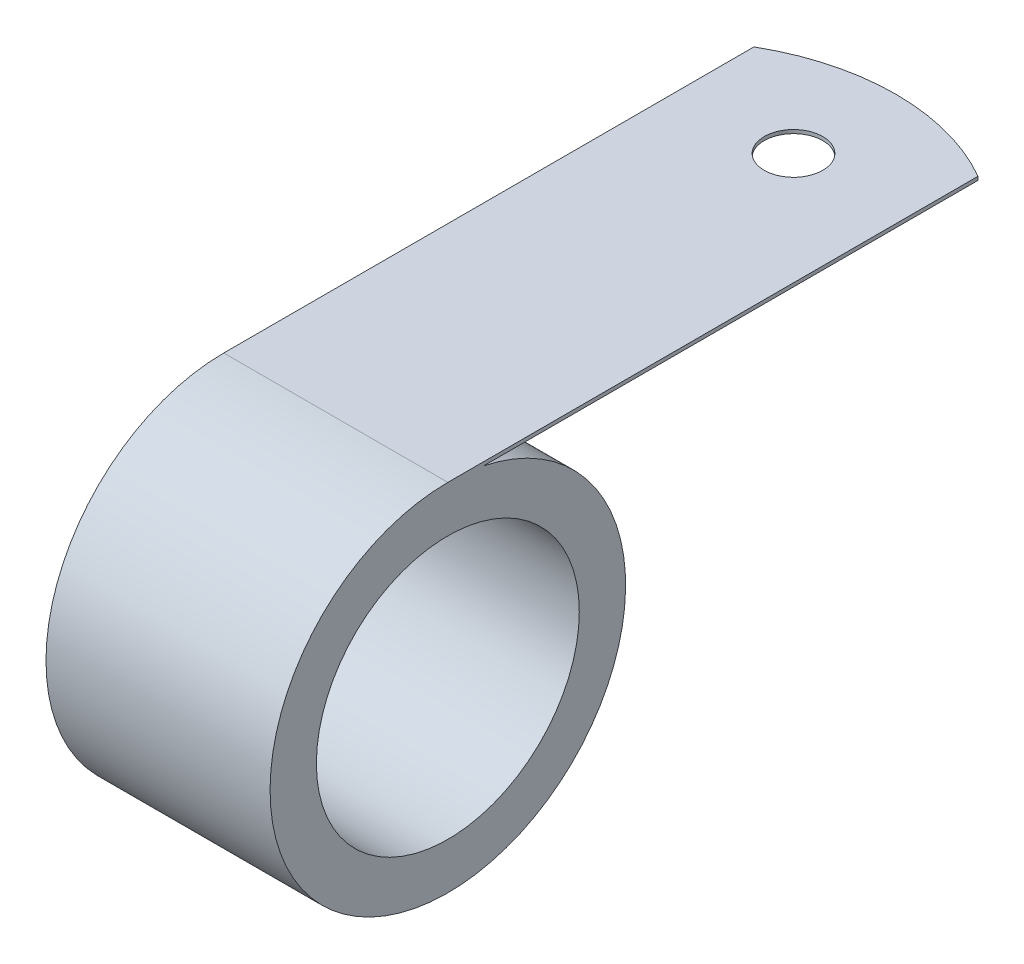
ISO-10303-21;
HEADER;
FILE_DESCRIPTION(('STEP AP214'),'2;1');
FILE_NAME('part.step','',(''),(''),'','','');
FILE_SCHEMA(('AUTOMOTIVE_DESIGN { 1 0 10303 214 1 1 1 1 }'));
ENDSEC;
DATA;
#1=APPLICATION_CONTEXT('core data for automotive mechanical design processes');
#2=APPLICATION_PROTOCOL_DEFINITION('international standard','automotive_design',2000,#1);
#3=PRODUCT_CONTEXT('',#1,'mechanical');
#4=PRODUCT('Part','Part','',(#3));
#5=PRODUCT_RELATED_PRODUCT_CATEGORY('part','',(#4));
#6=PRODUCT_DEFINITION_FORMATION('','',#4);
#7=PRODUCT_DEFINITION_CONTEXT('part definition',#1,'design');
#8=PRODUCT_DEFINITION('design','',#6,#7);
#9=PRODUCT_DEFINITION_SHAPE('','',#8);
#10=(LENGTH_UNIT() NAMED_UNIT(*) SI_UNIT(.MILLI.,.METRE.));
#11=(NAMED_UNIT(*) PLANE_ANGLE_UNIT() SI_UNIT($,.RADIAN.));
#12=(NAMED_UNIT(*) SI_UNIT($,.STERADIAN.) SOLID_ANGLE_UNIT());
#13=UNCERTAINTY_MEASURE_WITH_UNIT(LENGTH_MEASURE(1.E-05),#10,'distance_accuracy_value','');
#14=(GEOMETRIC_REPRESENTATION_CONTEXT(3) GLOBAL_UNCERTAINTY_ASSIGNED_CONTEXT((#13)) GLOBAL_UNIT_ASSIGNED_CONTEXT((#10,
#11,#12)) REPRESENTATION_CONTEXT('',''));
#15=CARTESIAN_POINT('',(0.,0.,0.));
#16=DIRECTION('',(0.,0.,1.));
#17=DIRECTION('',(1.,0.,0.));
#18=AXIS2_PLACEMENT_3D('',#15,#16,#17);
#19=CARTESIAN_POINT('',(9.525,0.,0.));
#20=DIRECTION('',(1.,0.,0.));
#21=DIRECTION('',(0.,0.,-1.));
#22=AXIS2_PLACEMENT_3D('',#19,#20,#21);
#23=PLANE('',#22);
#24=DIRECTION('',(0.,1.,0.));
#25=VECTOR('',#24,1.);
#26=CARTESIAN_POINT('',(9.525,-15.114,-45.0727839420936));
#27=LINE('',#26,#25);
#28=CARTESIAN_POINT('',(9.525,14.8082,-45.0727839420936));
#29=VERTEX_POINT('',#28);
#30=CARTESIAN_POINT('',(9.525,15.113,-45.0727839420936));
#31=VERTEX_POINT('',#30);
#32=EDGE_CURVE('E69',#29,#31,#27,.T.);
#33=ORIENTED_EDGE('',*,*,#32,.T.);
#34=DIRECTION('',(0.,0.,1.));
#35=VECTOR('',#34,1.);
#36=CARTESIAN_POINT('',(9.525,15.113,0.));
#37=LINE('',#36,#35);
#38=CARTESIAN_POINT('',(9.525,15.113,0.));
#39=VERTEX_POINT('',#38);
#40=EDGE_CURVE('E50',#31,#39,#37,.T.);
#41=ORIENTED_EDGE('',*,*,#40,.T.);
#42=CARTESIAN_POINT('',(9.525,0.,0.));
#43=DIRECTION('',(1.,0.,0.));
#44=DIRECTION('',(0.,0.,-1.));
#45=AXIS2_PLACEMENT_3D('',#42,#43,#44);
#46=CIRCLE('',#45,15.113);
#47=CARTESIAN_POINT('',(9.525,14.8082,-3.01993075417301));
#48=VERTEX_POINT('',#47);
#49=EDGE_CURVE('E94',#39,#48,#46,.T.);
#50=ORIENTED_EDGE('',*,*,#49,.T.);
#51=DIRECTION('',(0.,0.,-1.));
#52=VECTOR('',#51,1.);
#53=CARTESIAN_POINT('',(9.525,14.8082,-3.01993075417301));
#54=LINE('',#53,#52);
#55=EDGE_CURVE('E96',#48,#29,#54,.T.);
#56=ORIENTED_EDGE('',*,*,#55,.T.);
#57=EDGE_LOOP('',(#33,#41,#50,#56));
#58=FACE_BOUND('',#57,.T.);
#59=CARTESIAN_POINT('',(9.525,0.,0.));
#60=DIRECTION('',(1.,0.,0.));
#61=DIRECTION('',(0.,0.,-1.));
#62=AXIS2_PLACEMENT_3D('',#59,#60,#61);
#63=CIRCLE('',#62,11.176);
#64=CARTESIAN_POINT('',(9.525,0.,11.176));
#65=VERTEX_POINT('',#64);
#66=EDGE_CURVE('E105',#65,#65,#63,.T.);
#67=ORIENTED_EDGE('',*,*,#66,.F.);
#68=EDGE_LOOP('',(#67));
#69=FACE_BOUND('',#68,.T.);
#70=ADVANCED_FACE('F33',(#58,#69),#23,.T.);
#71=CARTESIAN_POINT('',(-9.525,0.,0.));
#72=DIRECTION('',(1.,0.,0.));
#73=DIRECTION('',(0.,0.,-1.));
#74=AXIS2_PLACEMENT_3D('',#71,#72,#73);
#75=PLANE('',#74);
#76=DIRECTION('',(0.,0.,1.));
#77=VECTOR('',#76,1.);
#78=CARTESIAN_POINT('',(-9.525,15.113,0.));
#79=LINE('',#78,#77);
#80=CARTESIAN_POINT('',(-9.525,15.113,-45.0727839420936));
#81=VERTEX_POINT('',#80);
#82=CARTESIAN_POINT('',(-9.525,15.113,0.));
#83=VERTEX_POINT('',#82);
#84=EDGE_CURVE('E82',#81,#83,#79,.T.);
#85=ORIENTED_EDGE('',*,*,#84,.F.);
#86=DIRECTION('',(0.,1.,0.));
#87=VECTOR('',#86,1.);
#88=CARTESIAN_POINT('',(-9.525,-15.114,-45.0727839420936));
#89=LINE('',#88,#87);
#90=CARTESIAN_POINT('',(-9.525,14.8082,-45.0727839420936));
#91=VERTEX_POINT('',#90);
#92=EDGE_CURVE('E86',#91,#81,#89,.T.);
#93=ORIENTED_EDGE('',*,*,#92,.F.);
#94=DIRECTION('',(0.,0.,-1.));
#95=VECTOR('',#94,1.);
#96=CARTESIAN_POINT('',(-9.525,14.8082,-3.01993075417301));
#97=LINE('',#96,#95);
#98=CARTESIAN_POINT('',(-9.525,14.8082,-3.01993075417301));
#99=VERTEX_POINT('',#98);
#100=EDGE_CURVE('E62',#99,#91,#97,.T.);
#101=ORIENTED_EDGE('',*,*,#100,.F.);
#102=CARTESIAN_POINT('',(-9.525,0.,0.));
#103=DIRECTION('',(1.,0.,0.));
#104=DIRECTION('',(0.,0.,-1.));
#105=AXIS2_PLACEMENT_3D('',#102,#103,#104);
#106=CIRCLE('',#105,15.113);
#107=EDGE_CURVE('E93',#83,#99,#106,.T.);
#108=ORIENTED_EDGE('',*,*,#107,.F.);
#109=EDGE_LOOP('',(#85,#93,#101,#108));
#110=FACE_BOUND('',#109,.T.);
#111=CARTESIAN_POINT('',(-9.525,0.,0.));
#112=DIRECTION('',(1.,0.,0.));
#113=DIRECTION('',(0.,0.,-1.));
#114=AXIS2_PLACEMENT_3D('',#111,#112,#113);
#115=CIRCLE('',#114,11.176);
#116=CARTESIAN_POINT('',(-9.525,0.,11.176));
#117=VERTEX_POINT('',#116);
#118=EDGE_CURVE('E108',#117,#117,#115,.T.);
#119=ORIENTED_EDGE('',*,*,#118,.T.);
#120=EDGE_LOOP('',(#119));
#121=FACE_BOUND('',#120,.T.);
#122=ADVANCED_FACE('F90',(#110,#121),#75,.F.);
#123=CARTESIAN_POINT('',(9.525,0.,0.));
#124=DIRECTION('',(-1.,0.,0.));
#125=DIRECTION('',(0.,0.,1.));
#126=AXIS2_PLACEMENT_3D('',#123,#124,#125);
#127=CYLINDRICAL_SURFACE('',#126,15.113);
#128=ORIENTED_EDGE('',*,*,#107,.T.);
#129=DIRECTION('',(-1.,0.,0.));
#130=VECTOR('',#129,1.);
#131=CARTESIAN_POINT('',(9.525,14.8082,-3.01993075417301));
#132=LINE('',#131,#130);
#133=EDGE_CURVE('E11',#48,#99,#132,.T.);
#134=ORIENTED_EDGE('',*,*,#133,.F.);
#135=ORIENTED_EDGE('',*,*,#49,.F.);
#136=DIRECTION('',(-1.,0.,0.));
#137=VECTOR('',#136,1.);
#138=CARTESIAN_POINT('',(9.525,15.113,0.));
#139=LINE('',#138,#137);
#140=EDGE_CURVE('E42',#39,#83,#139,.T.);
#141=ORIENTED_EDGE('',*,*,#140,.T.);
#142=EDGE_LOOP('',(#128,#134,#135,#141));
#143=FACE_BOUND('',#142,.T.);
#144=ADVANCED_FACE('F35',(#143),#127,.T.);
#145=CARTESIAN_POINT('',(9.525,14.8082,-3.01993075417301));
#146=DIRECTION('',(0.,1.,0.));
#147=DIRECTION('',(0.,0.,1.));
#148=AXIS2_PLACEMENT_3D('',#145,#146,#147);
#149=PLANE('',#148);
#150=CARTESIAN_POINT('',(0.,14.8082,-38.9128));
#151=DIRECTION('',(0.,1.,0.));
#152=DIRECTION('',(0.,0.,1.));
#153=AXIS2_PLACEMENT_3D('',#150,#151,#152);
#154=CIRCLE('',#153,2.4892);
#155=CARTESIAN_POINT('',(0.,14.8082,-36.4236));
#156=VERTEX_POINT('',#155);
#157=EDGE_CURVE('E117',#156,#156,#154,.F.);
#158=ORIENTED_EDGE('',*,*,#157,.F.);
#159=EDGE_LOOP('',(#158));
#160=FACE_BOUND('',#159,.T.);
#161=ORIENTED_EDGE('',*,*,#100,.T.);
#162=CARTESIAN_POINT('',(0.,14.8082,-28.575));
#163=DIRECTION('',(0.,1.,0.));
#164=DIRECTION('',(0.,0.,1.));
#165=AXIS2_PLACEMENT_3D('',#162,#163,#164);
#166=CIRCLE('',#165,19.05);
#167=EDGE_CURVE('E84',#29,#91,#166,.T.);
#168=ORIENTED_EDGE('',*,*,#167,.F.);
#169=ORIENTED_EDGE('',*,*,#55,.F.);
#170=ORIENTED_EDGE('',*,*,#133,.T.);
#171=EDGE_LOOP('',(#161,#168,#169,#170));
#172=FACE_BOUND('',#171,.T.);
#173=ADVANCED_FACE('F128',(#160,#172),#149,.F.);
#174=CARTESIAN_POINT('',(9.525,15.113,0.));
#175=DIRECTION('',(0.,-1.,0.));
#176=DIRECTION('',(0.,0.,-1.));
#177=AXIS2_PLACEMENT_3D('',#174,#175,#176);
#178=PLANE('',#177);
#179=CARTESIAN_POINT('',(0.,15.113,-38.9128));
#180=DIRECTION('',(0.,1.,0.));
#181=DIRECTION('',(0.,0.,1.));
#182=AXIS2_PLACEMENT_3D('',#179,#180,#181);
#183=CIRCLE('',#182,2.4892);
#184=CARTESIAN_POINT('',(0.,15.113,-36.4236));
#185=VERTEX_POINT('',#184);
#186=EDGE_CURVE('E88',#185,#185,#183,.T.);
#187=ORIENTED_EDGE('',*,*,#186,.F.);
#188=EDGE_LOOP('',(#187));
#189=FACE_BOUND('',#188,.T.);
#190=CARTESIAN_POINT('',(0.,15.113,-28.575));
#191=DIRECTION('',(0.,-1.,0.));
#192=DIRECTION('',(0.,0.,1.));
#193=AXIS2_PLACEMENT_3D('',#190,#191,#192);
#194=CIRCLE('',#193,19.05);
#195=EDGE_CURVE('E78',#81,#31,#194,.T.);
#196=ORIENTED_EDGE('',*,*,#195,.F.);
#197=ORIENTED_EDGE('',*,*,#84,.T.);
#198=ORIENTED_EDGE('',*,*,#140,.F.);
#199=ORIENTED_EDGE('',*,*,#40,.F.);
#200=EDGE_LOOP('',(#196,#197,#198,#199));
#201=FACE_BOUND('',#200,.T.);
#202=ADVANCED_FACE('F80',(#189,#201),#178,.F.);
#203=CARTESIAN_POINT('',(9.525,0.,0.));
#204=DIRECTION('',(-1.,0.,0.));
#205=DIRECTION('',(0.,0.,1.));
#206=AXIS2_PLACEMENT_3D('',#203,#204,#205);
#207=CYLINDRICAL_SURFACE('',#206,11.176);
#208=CARTESIAN_POINT('',(9.525,0.,11.176));
#209=CARTESIAN_POINT('',(9.3265625,0.,11.176));
#210=CARTESIAN_POINT('',(9.128125,0.,11.176));
#211=CARTESIAN_POINT('',(8.73125,0.,11.176));
#212=CARTESIAN_POINT('',(8.5328125,0.,11.176));
#213=CARTESIAN_POINT('',(8.1359375,0.,11.176));
#214=CARTESIAN_POINT('',(7.9375,0.,11.176));
#215=CARTESIAN_POINT('',(7.540625,0.,11.176));
#216=CARTESIAN_POINT('',(7.3421875,0.,11.176));
#217=CARTESIAN_POINT('',(6.9453125,0.,11.176));
#218=CARTESIAN_POINT('',(6.746875,0.,11.176));
#219=CARTESIAN_POINT('',(6.35,0.,11.176));
#220=CARTESIAN_POINT('',(6.1515625,0.,11.176));
#221=CARTESIAN_POINT('',(5.7546875,0.,11.176));
#222=CARTESIAN_POINT('',(5.55625,0.,11.176));
#223=CARTESIAN_POINT('',(5.159375,0.,11.176));
#224=CARTESIAN_POINT('',(4.9609375,0.,11.176));
#225=CARTESIAN_POINT('',(4.5640625,0.,11.176));
#226=CARTESIAN_POINT('',(4.365625,0.,11.176));
#227=CARTESIAN_POINT('',(3.96875,0.,11.176));
#228=CARTESIAN_POINT('',(3.7703125,0.,11.176));
#229=CARTESIAN_POINT('',(3.3734375,0.,11.176));
#230=CARTESIAN_POINT('',(3.175,0.,11.176));
#231=CARTESIAN_POINT('',(2.778125,0.,11.176));
#232=CARTESIAN_POINT('',(2.5796875,0.,11.176));
#233=CARTESIAN_POINT('',(2.1828125,0.,11.176));
#234=CARTESIAN_POINT('',(1.984375,0.,11.176));
#235=CARTESIAN_POINT('',(1.5875,0.,11.176));
#236=CARTESIAN_POINT('',(1.3890625,0.,11.176));
#237=CARTESIAN_POINT('',(0.992187499999999,0.,11.176));
#238=CARTESIAN_POINT('',(0.793749999999999,0.,11.176));
#239=CARTESIAN_POINT('',(0.396874999999998,0.,11.176));
#240=CARTESIAN_POINT('',(0.198437499999998,0.,11.176));
#241=CARTESIAN_POINT('',(-0.198437500000002,0.,11.176));
#242=CARTESIAN_POINT('',(-0.396875000000002,0.,11.176));
#243=CARTESIAN_POINT('',(-0.793750000000002,0.,11.176));
#244=CARTESIAN_POINT('',(-0.992187500000002,0.,11.176));
#245=CARTESIAN_POINT('',(-1.3890625,0.,11.176));
#246=CARTESIAN_POINT('',(-1.5875,0.,11.176));
#247=CARTESIAN_POINT('',(-1.984375,0.,11.176));
#248=CARTESIAN_POINT('',(-2.1828125,0.,11.176));
#249=CARTESIAN_POINT('',(-2.5796875,0.,11.176));
#250=CARTESIAN_POINT('',(-2.778125,0.,11.176));
#251=CARTESIAN_POINT('',(-3.175,0.,11.176));
#252=CARTESIAN_POINT('',(-3.3734375,0.,11.176));
#253=CARTESIAN_POINT('',(-3.7703125,0.,11.176));
#254=CARTESIAN_POINT('',(-3.96875,0.,11.176));
#255=CARTESIAN_POINT('',(-4.365625,0.,11.176));
#256=CARTESIAN_POINT('',(-4.5640625,0.,11.176));
#257=CARTESIAN_POINT('',(-4.9609375,0.,11.176));
#258=CARTESIAN_POINT('',(-5.159375,0.,11.176));
#259=CARTESIAN_POINT('',(-5.55625,0.,11.176));
#260=CARTESIAN_POINT('',(-5.7546875,0.,11.176));
#261=CARTESIAN_POINT('',(-6.1515625,0.,11.176));
#262=CARTESIAN_POINT('',(-6.35,0.,11.176));
#263=CARTESIAN_POINT('',(-6.746875,0.,11.176));
#264=CARTESIAN_POINT('',(-6.9453125,0.,11.176));
#265=CARTESIAN_POINT('',(-7.3421875,0.,11.176));
#266=CARTESIAN_POINT('',(-7.540625,0.,11.176));
#267=CARTESIAN_POINT('',(-7.9375,0.,11.176));
#268=CARTESIAN_POINT('',(-8.1359375,0.,11.176));
#269=CARTESIAN_POINT('',(-8.5328125,0.,11.176));
#270=CARTESIAN_POINT('',(-8.73125,0.,11.176));
#271=CARTESIAN_POINT('',(-9.128125,0.,11.176));
#272=CARTESIAN_POINT('',(-9.3265625,0.,11.176));
#273=CARTESIAN_POINT('',(-9.525,0.,11.176));
#274=B_SPLINE_CURVE_WITH_KNOTS('',3,(#208,#209,#210,#211,#212,#213,#214,#215,#216,#217,#218,
#219,#220,#221,#222,#223,#224,#225,#226,#227,#228,#229,#230,#231,#232,#233,#234,#235,#236,#237,
#238,#239,#240,#241,#242,#243,#244,#245,#246,#247,#248,#249,#250,#251,#252,#253,#254,#255,#256,
#257,#258,#259,#260,#261,#262,#263,#264,#265,#266,#267,#268,#269,#270,#271,#272,#273),
.UNSPECIFIED.,.F.,.F.,(4,2,2,2,2,2,2,2,2,2,2,2,2,2,2,2,2,2,2,2,2,2,2,2,2,2,2,2,2,2,2,2,4),(0.,
0.595312499999999,1.190625,1.7859375,2.38125,2.9765625,3.571875,4.1671875,4.7625,5.3578125,
5.953125,6.5484375,7.14375,7.7390625,8.334375,8.9296875,9.525,10.1203125,10.715625,11.3109375,
11.90625,12.5015625,13.096875,13.6921875,14.2875,14.8828125,15.478125,16.0734375,16.66875,
17.2640625,17.859375,18.4546875,19.05),.UNSPECIFIED.);
#275=EDGE_CURVE('BSEAM127',#65,#117,#274,.T.);
#276=ORIENTED_EDGE('',*,*,#66,.T.);
#277=ORIENTED_EDGE('',*,*,#118,.F.);
#278=ORIENTED_EDGE('',*,*,#275,.T.);
#279=ORIENTED_EDGE('',*,*,#275,.F.);
#280=EDGE_LOOP('',(#276,#278,#277,#279));
#281=FACE_BOUND('',#280,.T.);
#282=ADVANCED_FACE('F127',(#281),#207,.F.);
#283=CARTESIAN_POINT('',(0.,-15.114,-28.575));
#284=DIRECTION('',(0.,1.,0.));
#285=DIRECTION('',(0.,0.,1.));
#286=AXIS2_PLACEMENT_3D('',#283,#284,#285);
#287=CYLINDRICAL_SURFACE('',#286,19.05);
#288=ORIENTED_EDGE('',*,*,#167,.T.);
#289=ORIENTED_EDGE('',*,*,#92,.T.);
#290=ORIENTED_EDGE('',*,*,#195,.T.);
#291=ORIENTED_EDGE('',*,*,#32,.F.);
#292=EDGE_LOOP('',(#288,#289,#290,#291));
#293=FACE_BOUND('',#292,.T.);
#294=ADVANCED_FACE('F87',(#293),#287,.T.);
#295=CARTESIAN_POINT('',(0.,-15.114,-38.9128));
#296=DIRECTION('',(0.,1.,0.));
#297=DIRECTION('',(0.,0.,1.));
#298=AXIS2_PLACEMENT_3D('',#295,#296,#297);
#299=CYLINDRICAL_SURFACE('',#298,2.4892);
#300=CARTESIAN_POINT('',(0.,15.113,-36.4236));
#301=CARTESIAN_POINT('',(0.,15.109825,-36.4236));
#302=CARTESIAN_POINT('',(0.,15.10665,-36.4236));
#303=CARTESIAN_POINT('',(0.,15.1003,-36.4236));
#304=CARTESIAN_POINT('',(0.,15.097125,-36.4236));
#305=CARTESIAN_POINT('',(0.,15.090775,-36.4236));
#306=CARTESIAN_POINT('',(0.,15.0876,-36.4236));
#307=CARTESIAN_POINT('',(0.,15.08125,-36.4236));
#308=CARTESIAN_POINT('',(0.,15.078075,-36.4236));
#309=CARTESIAN_POINT('',(0.,15.071725,-36.4236));
#310=CARTESIAN_POINT('',(0.,15.06855,-36.4236));
#311=CARTESIAN_POINT('',(0.,15.0622,-36.4236));
#312=CARTESIAN_POINT('',(0.,15.059025,-36.4236));
#313=CARTESIAN_POINT('',(0.,15.052675,-36.4236));
#314=CARTESIAN_POINT('',(0.,15.0495,-36.4236));
#315=CARTESIAN_POINT('',(0.,15.04315,-36.4236));
#316=CARTESIAN_POINT('',(0.,15.039975,-36.4236));
#317=CARTESIAN_POINT('',(0.,15.033625,-36.4236));
#318=CARTESIAN_POINT('',(0.,15.03045,-36.4236));
#319=CARTESIAN_POINT('',(0.,15.0241,-36.4236));
#320=CARTESIAN_POINT('',(0.,15.020925,-36.4236));
#321=CARTESIAN_POINT('',(0.,15.014575,-36.4236));
#322=CARTESIAN_POINT('',(0.,15.0114,-36.4236));
#323=CARTESIAN_POINT('',(0.,15.00505,-36.4236));
#324=CARTESIAN_POINT('',(0.,15.001875,-36.4236));
#325=CARTESIAN_POINT('',(0.,14.995525,-36.4236));
#326=CARTESIAN_POINT('',(0.,14.99235,-36.4236));
#327=CARTESIAN_POINT('',(0.,14.986,-36.4236));
#328=CARTESIAN_POINT('',(0.,14.982825,-36.4236));
#329=CARTESIAN_POINT('',(0.,14.976475,-36.4236));
#330=CARTESIAN_POINT('',(0.,14.9733,-36.4236));
#331=CARTESIAN_POINT('',(0.,14.96695,-36.4236));
#332=CARTESIAN_POINT('',(0.,14.963775,-36.4236));
#333=CARTESIAN_POINT('',(0.,14.957425,-36.4236));
#334=CARTESIAN_POINT('',(0.,14.95425,-36.4236));
#335=CARTESIAN_POINT('',(0.,14.9479,-36.4236));
#336=CARTESIAN_POINT('',(0.,14.944725,-36.4236));
#337=CARTESIAN_POINT('',(0.,14.938375,-36.4236));
#338=CARTESIAN_POINT('',(0.,14.9352,-36.4236));
#339=CARTESIAN_POINT('',(0.,14.92885,-36.4236));
#340=CARTESIAN_POINT('',(0.,14.925675,-36.4236));
#341=CARTESIAN_POINT('',(0.,14.919325,-36.4236));
#342=CARTESIAN_POINT('',(0.,14.91615,-36.4236));
#343=CARTESIAN_POINT('',(0.,14.9098,-36.4236));
#344=CARTESIAN_POINT('',(0.,14.906625,-36.4236));
#345=CARTESIAN_POINT('',(0.,14.900275,-36.4236));
#346=CARTESIAN_POINT('',(0.,14.8971,-36.4236));
#347=CARTESIAN_POINT('',(0.,14.89075,-36.4236));
#348=CARTESIAN_POINT('',(0.,14.887575,-36.4236));
#349=CARTESIAN_POINT('',(0.,14.881225,-36.4236));
#350=CARTESIAN_POINT('',(0.,14.87805,-36.4236));
#351=CARTESIAN_POINT('',(0.,14.8717,-36.4236));
#352=CARTESIAN_POINT('',(0.,14.868525,-36.4236));
#353=CARTESIAN_POINT('',(0.,14.862175,-36.4236));
#354=CARTESIAN_POINT('',(0.,14.859,-36.4236));
#355=CARTESIAN_POINT('',(0.,14.85265,-36.4236));
#356=CARTESIAN_POINT('',(0.,14.849475,-36.4236));
#357=CARTESIAN_POINT('',(0.,14.843125,-36.4236));
#358=CARTESIAN_POINT('',(0.,14.83995,-36.4236));
#359=CARTESIAN_POINT('',(0.,14.8336,-36.4236));
#360=CARTESIAN_POINT('',(0.,14.830425,-36.4236));
#361=CARTESIAN_POINT('',(0.,14.824075,-36.4236));
#362=CARTESIAN_POINT('',(0.,14.8209,-36.4236));
#363=CARTESIAN_POINT('',(0.,14.81455,-36.4236));
#364=CARTESIAN_POINT('',(0.,14.811375,-36.4236));
#365=CARTESIAN_POINT('',(0.,14.8082,-36.4236));
#366=B_SPLINE_CURVE_WITH_KNOTS('',3,(#300,#301,#302,#303,#304,#305,#306,#307,#308,#309,#310,
#311,#312,#313,#314,#315,#316,#317,#318,#319,#320,#321,#322,#323,#324,#325,#326,#327,#328,#329,
#330,#331,#332,#333,#334,#335,#336,#337,#338,#339,#340,#341,#342,#343,#344,#345,#346,#347,#348,
#349,#350,#351,#352,#353,#354,#355,#356,#357,#358,#359,#360,#361,#362,#363,#364,#365),
.UNSPECIFIED.,.F.,.F.,(4,2,2,2,2,2,2,2,2,2,2,2,2,2,2,2,2,2,2,2,2,2,2,2,2,2,2,2,2,2,2,2,4),(0.,
0.00952499999999981,0.0190499999999996,0.0285749999999994,0.0380999999999992,0.0476249999999991,
0.0571499999999989,0.0666749999999987,0.0761999999999985,0.0857250000000018,0.0952500000000016,
0.104775000000001,0.114300000000001,0.123825000000001,0.133350000000001,0.142875000000001,
0.1524,0.161925,0.17145,0.180975,0.1905,0.200025,0.209549999999999,0.219074999999999,
0.228600000000002,0.238125000000002,0.247650000000002,0.257175000000002,0.266700000000002,
0.276225000000001,0.285750000000001,0.295275000000001,0.304800000000001),.UNSPECIFIED.);
#367=EDGE_CURVE('BSEAM123',#185,#156,#366,.T.);
#368=ORIENTED_EDGE('',*,*,#186,.T.);
#369=ORIENTED_EDGE('',*,*,#157,.T.);
#370=ORIENTED_EDGE('',*,*,#367,.T.);
#371=ORIENTED_EDGE('',*,*,#367,.F.);
#372=EDGE_LOOP('',(#368,#370,#369,#371));
#373=FACE_BOUND('',#372,.T.);
#374=ADVANCED_FACE('F123',(#373),#299,.F.);
#375=CLOSED_SHELL('',(#70,#122,#144,#173,#202,#282,#294,#374));
#376=MANIFOLD_SOLID_BREP('B2',#375);
#377=ADVANCED_BREP_SHAPE_REPRESENTATION('',(#18,#376),#14);
#378=SHAPE_DEFINITION_REPRESENTATION(#9,#377);
ENDSEC;
END-ISO-10303-21;
